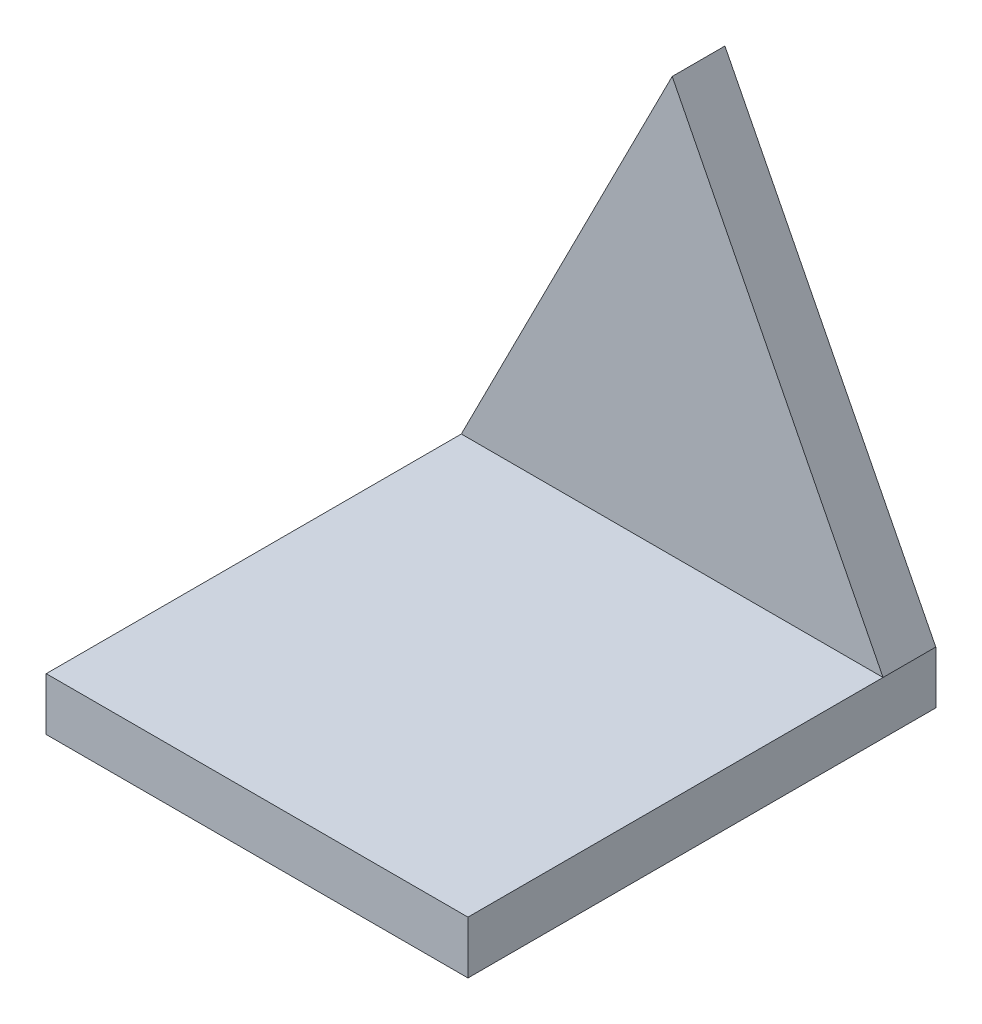
ISO-10303-21;
HEADER;
FILE_DESCRIPTION(('STEP AP214'),'2;1');
FILE_NAME('part.step','',(''),(''),'','','');
FILE_SCHEMA(('AUTOMOTIVE_DESIGN { 1 0 10303 214 1 1 1 1 }'));
ENDSEC;
DATA;
#1=APPLICATION_CONTEXT('core data for automotive mechanical design processes');
#2=APPLICATION_PROTOCOL_DEFINITION('international standard','automotive_design',2000,#1);
#3=PRODUCT_CONTEXT('',#1,'mechanical');
#4=PRODUCT('Part','Part','',(#3));
#5=PRODUCT_RELATED_PRODUCT_CATEGORY('part','',(#4));
#6=PRODUCT_DEFINITION_FORMATION('','',#4);
#7=PRODUCT_DEFINITION_CONTEXT('part definition',#1,'design');
#8=PRODUCT_DEFINITION('design','',#6,#7);
#9=PRODUCT_DEFINITION_SHAPE('','',#8);
#10=(LENGTH_UNIT() NAMED_UNIT(*) SI_UNIT(.MILLI.,.METRE.));
#11=(NAMED_UNIT(*) PLANE_ANGLE_UNIT() SI_UNIT($,.RADIAN.));
#12=(NAMED_UNIT(*) SI_UNIT($,.STERADIAN.) SOLID_ANGLE_UNIT());
#13=UNCERTAINTY_MEASURE_WITH_UNIT(LENGTH_MEASURE(1.E-05),#10,'distance_accuracy_value','');
#14=(GEOMETRIC_REPRESENTATION_CONTEXT(3) GLOBAL_UNCERTAINTY_ASSIGNED_CONTEXT((#13)) GLOBAL_UNIT_ASSIGNED_CONTEXT((#10,
#11,#12)) REPRESENTATION_CONTEXT('',''));
#15=CARTESIAN_POINT('',(0.,0.,0.));
#16=DIRECTION('',(0.,0.,1.));
#17=DIRECTION('',(1.,0.,0.));
#18=AXIS2_PLACEMENT_3D('',#15,#16,#17);
#19=CARTESIAN_POINT('',(0.,3.175,0.));
#20=DIRECTION('',(1.,0.,0.));
#21=DIRECTION('',(0.,0.,-1.));
#22=AXIS2_PLACEMENT_3D('',#19,#20,#21);
#23=PLANE('',#22);
#24=DIRECTION('',(0.,0.,-1.));
#25=VECTOR('',#24,1.);
#26=CARTESIAN_POINT('',(0.,3.175,65.3160269781736));
#27=LINE('',#26,#25);
#28=CARTESIAN_POINT('',(0.,3.175,-25.));
#29=VERTEX_POINT('',#28);
#30=CARTESIAN_POINT('',(0.,3.175,-28.175));
#31=VERTEX_POINT('',#30);
#32=EDGE_CURVE('E56',#29,#31,#27,.T.);
#33=ORIENTED_EDGE('',*,*,#32,.T.);
#34=DIRECTION('',(0.,-1.,0.));
#35=VECTOR('',#34,1.);
#36=CARTESIAN_POINT('',(0.,3.175,-28.175));
#37=LINE('',#36,#35);
#38=CARTESIAN_POINT('',(0.,0.,-28.175));
#39=VERTEX_POINT('',#38);
#40=EDGE_CURVE('E104',#31,#39,#37,.T.);
#41=ORIENTED_EDGE('',*,*,#40,.T.);
#42=DIRECTION('',(0.,0.,1.));
#43=VECTOR('',#42,1.);
#44=CARTESIAN_POINT('',(0.,0.,0.));
#45=LINE('',#44,#43);
#46=CARTESIAN_POINT('',(0.,0.,0.));
#47=VERTEX_POINT('',#46);
#48=EDGE_CURVE('E93',#39,#47,#45,.T.);
#49=ORIENTED_EDGE('',*,*,#48,.T.);
#50=DIRECTION('',(0.,-1.,0.));
#51=VECTOR('',#50,1.);
#52=CARTESIAN_POINT('',(0.,3.175,0.));
#53=LINE('',#52,#51);
#54=CARTESIAN_POINT('',(0.,3.175,0.));
#55=VERTEX_POINT('',#54);
#56=EDGE_CURVE('E11',#55,#47,#53,.T.);
#57=ORIENTED_EDGE('',*,*,#56,.F.);
#58=DIRECTION('',(0.,0.,1.));
#59=VECTOR('',#58,1.);
#60=CARTESIAN_POINT('',(0.,3.175,0.));
#61=LINE('',#60,#59);
#62=EDGE_CURVE('E139',#29,#55,#61,.T.);
#63=ORIENTED_EDGE('',*,*,#62,.F.);
#64=EDGE_LOOP('',(#33,#41,#49,#57,#63));
#65=FACE_BOUND('',#64,.T.);
#66=ADVANCED_FACE('F31',(#65),#23,.F.);
#67=CARTESIAN_POINT('',(25.4,3.175,0.));
#68=DIRECTION('',(-1.,0.,0.));
#69=DIRECTION('',(0.,0.,1.));
#70=AXIS2_PLACEMENT_3D('',#67,#68,#69);
#71=PLANE('',#70);
#72=DIRECTION('',(0.,0.,-1.));
#73=VECTOR('',#72,1.);
#74=CARTESIAN_POINT('',(25.4,3.175,65.3160269781736));
#75=LINE('',#74,#73);
#76=CARTESIAN_POINT('',(25.4,3.175,-25.));
#77=VERTEX_POINT('',#76);
#78=CARTESIAN_POINT('',(25.4,3.175,-28.175));
#79=VERTEX_POINT('',#78);
#80=EDGE_CURVE('E106',#77,#79,#75,.T.);
#81=ORIENTED_EDGE('',*,*,#80,.F.);
#82=DIRECTION('',(0.,0.,-1.));
#83=VECTOR('',#82,1.);
#84=CARTESIAN_POINT('',(25.4,3.175,0.));
#85=LINE('',#84,#83);
#86=CARTESIAN_POINT('',(25.4,3.175,0.));
#87=VERTEX_POINT('',#86);
#88=EDGE_CURVE('E96',#87,#77,#85,.T.);
#89=ORIENTED_EDGE('',*,*,#88,.F.);
#90=DIRECTION('',(0.,-1.,0.));
#91=VECTOR('',#90,1.);
#92=CARTESIAN_POINT('',(25.4,3.175,0.));
#93=LINE('',#92,#91);
#94=CARTESIAN_POINT('',(25.4,0.,0.));
#95=VERTEX_POINT('',#94);
#96=EDGE_CURVE('E40',#87,#95,#93,.T.);
#97=ORIENTED_EDGE('',*,*,#96,.T.);
#98=DIRECTION('',(0.,0.,-1.));
#99=VECTOR('',#98,1.);
#100=CARTESIAN_POINT('',(25.4,0.,0.));
#101=LINE('',#100,#99);
#102=CARTESIAN_POINT('',(25.4,0.,-28.175));
#103=VERTEX_POINT('',#102);
#104=EDGE_CURVE('E148',#95,#103,#101,.T.);
#105=ORIENTED_EDGE('',*,*,#104,.T.);
#106=DIRECTION('',(0.,-1.,0.));
#107=VECTOR('',#106,1.);
#108=CARTESIAN_POINT('',(25.4,3.175,-28.175));
#109=LINE('',#108,#107);
#110=EDGE_CURVE('E109',#79,#103,#109,.T.);
#111=ORIENTED_EDGE('',*,*,#110,.F.);
#112=EDGE_LOOP('',(#81,#89,#97,#105,#111));
#113=FACE_BOUND('',#112,.T.);
#114=ADVANCED_FACE('F107',(#113),#71,.F.);
#115=CARTESIAN_POINT('',(0.,3.175,-28.175));
#116=DIRECTION('',(0.,0.,1.));
#117=DIRECTION('',(1.,0.,0.));
#118=AXIS2_PLACEMENT_3D('',#115,#116,#117);
#119=PLANE('',#118);
#120=DIRECTION('',(-0.452910453651516,-0.891556011125032,0.));
#121=VECTOR('',#120,1.);
#122=CARTESIAN_POINT('',(0.,3.175,-28.175));
#123=LINE('',#122,#121);
#124=CARTESIAN_POINT('',(12.7,28.175,-28.175));
#125=VERTEX_POINT('',#124);
#126=EDGE_CURVE('E94',#125,#31,#123,.T.);
#127=ORIENTED_EDGE('',*,*,#126,.F.);
#128=DIRECTION('',(-0.452910453651516,0.891556011125032,0.));
#129=VECTOR('',#128,1.);
#130=CARTESIAN_POINT('',(20.1897518727187,13.4313939513411,-28.175));
#131=LINE('',#130,#129);
#132=EDGE_CURVE('E48',#79,#125,#131,.T.);
#133=ORIENTED_EDGE('',*,*,#132,.F.);
#134=ORIENTED_EDGE('',*,*,#110,.T.);
#135=DIRECTION('',(-1.,0.,0.));
#136=VECTOR('',#135,1.);
#137=CARTESIAN_POINT('',(0.,0.,-28.175));
#138=LINE('',#137,#136);
#139=EDGE_CURVE('E140',#103,#39,#138,.T.);
#140=ORIENTED_EDGE('',*,*,#139,.T.);
#141=ORIENTED_EDGE('',*,*,#40,.F.);
#142=EDGE_LOOP('',(#127,#133,#134,#140,#141));
#143=FACE_BOUND('',#142,.T.);
#144=ADVANCED_FACE('F159',(#143),#119,.F.);
#145=CARTESIAN_POINT('',(0.,28.175,-25.));
#146=DIRECTION('',(0.,0.,-1.));
#147=DIRECTION('',(-1.,0.,0.));
#148=AXIS2_PLACEMENT_3D('',#145,#146,#147);
#149=PLANE('',#148);
#150=DIRECTION('',(0.452910453651516,0.891556011125032,0.));
#151=VECTOR('',#150,1.);
#152=CARTESIAN_POINT('',(10.0948759363594,23.0468030243294,-25.));
#153=LINE('',#152,#151);
#154=CARTESIAN_POINT('',(12.7,28.175,-25.));
#155=VERTEX_POINT('',#154);
#156=EDGE_CURVE('E91',#29,#155,#153,.T.);
#157=ORIENTED_EDGE('',*,*,#156,.F.);
#158=DIRECTION('',(1.,0.,0.));
#159=VECTOR('',#158,1.);
#160=CARTESIAN_POINT('',(0.,3.175,-25.));
#161=LINE('',#160,#159);
#162=EDGE_CURVE('E34',#29,#77,#161,.T.);
#163=ORIENTED_EDGE('',*,*,#162,.T.);
#164=DIRECTION('',(0.452910453651516,-0.891556011125032,0.));
#165=VECTOR('',#164,1.);
#166=CARTESIAN_POINT('',(10.0948759363594,33.3031969756706,-25.));
#167=LINE('',#166,#165);
#168=EDGE_CURVE('E89',#155,#77,#167,.T.);
#169=ORIENTED_EDGE('',*,*,#168,.F.);
#170=EDGE_LOOP('',(#157,#163,#169));
#171=FACE_BOUND('',#170,.T.);
#172=ADVANCED_FACE('F87',(#171),#149,.F.);
#173=CARTESIAN_POINT('',(0.,3.175,-28.175));
#174=DIRECTION('',(0.,-1.,0.));
#175=DIRECTION('',(0.,0.,-1.));
#176=AXIS2_PLACEMENT_3D('',#173,#174,#175);
#177=PLANE('',#176);
#178=ORIENTED_EDGE('',*,*,#162,.F.);
#179=ORIENTED_EDGE('',*,*,#62,.T.);
#180=DIRECTION('',(1.,0.,0.));
#181=VECTOR('',#180,1.);
#182=CARTESIAN_POINT('',(0.,3.175,0.));
#183=LINE('',#182,#181);
#184=EDGE_CURVE('E100',#55,#87,#183,.T.);
#185=ORIENTED_EDGE('',*,*,#184,.T.);
#186=ORIENTED_EDGE('',*,*,#88,.T.);
#187=EDGE_LOOP('',(#178,#179,#185,#186));
#188=FACE_BOUND('',#187,.T.);
#189=ADVANCED_FACE('F98',(#188),#177,.F.);
#190=CARTESIAN_POINT('',(0.,3.175,0.));
#191=DIRECTION('',(0.,0.,-1.));
#192=DIRECTION('',(-1.,0.,0.));
#193=AXIS2_PLACEMENT_3D('',#190,#191,#192);
#194=PLANE('',#193);
#195=DIRECTION('',(1.,0.,0.));
#196=VECTOR('',#195,1.);
#197=CARTESIAN_POINT('',(0.,0.,0.));
#198=LINE('',#197,#196);
#199=EDGE_CURVE('E146',#47,#95,#198,.T.);
#200=ORIENTED_EDGE('',*,*,#199,.T.);
#201=ORIENTED_EDGE('',*,*,#96,.F.);
#202=ORIENTED_EDGE('',*,*,#184,.F.);
#203=ORIENTED_EDGE('',*,*,#56,.T.);
#204=EDGE_LOOP('',(#200,#201,#202,#203));
#205=FACE_BOUND('',#204,.T.);
#206=ADVANCED_FACE('F161',(#205),#194,.F.);
#207=CARTESIAN_POINT('',(0.,0.,-28.175));
#208=DIRECTION('',(0.,-1.,0.));
#209=DIRECTION('',(0.,0.,-1.));
#210=AXIS2_PLACEMENT_3D('',#207,#208,#209);
#211=PLANE('',#210);
#212=ORIENTED_EDGE('',*,*,#48,.F.);
#213=ORIENTED_EDGE('',*,*,#139,.F.);
#214=ORIENTED_EDGE('',*,*,#104,.F.);
#215=ORIENTED_EDGE('',*,*,#199,.F.);
#216=EDGE_LOOP('',(#212,#213,#214,#215));
#217=FACE_BOUND('',#216,.T.);
#218=ADVANCED_FACE('F158',(#217),#211,.T.);
#219=CARTESIAN_POINT('',(0.,3.175,65.3160269781736));
#220=DIRECTION('',(-0.891556011125032,0.452910453651516,0.));
#221=DIRECTION('',(-0.452910453651516,-0.891556011125032,0.));
#222=AXIS2_PLACEMENT_3D('',#219,#220,#221);
#223=PLANE('',#222);
#224=DIRECTION('',(0.,0.,-1.));
#225=VECTOR('',#224,1.);
#226=CARTESIAN_POINT('',(12.7,28.175,65.3160269781736));
#227=LINE('',#226,#225);
#228=EDGE_CURVE('E111',#155,#125,#227,.T.);
#229=ORIENTED_EDGE('',*,*,#228,.T.);
#230=ORIENTED_EDGE('',*,*,#126,.T.);
#231=ORIENTED_EDGE('',*,*,#32,.F.);
#232=ORIENTED_EDGE('',*,*,#156,.T.);
#233=EDGE_LOOP('',(#229,#230,#231,#232));
#234=FACE_BOUND('',#233,.T.);
#235=ADVANCED_FACE('F130',(#234),#223,.T.);
#236=CARTESIAN_POINT('',(12.7,28.175,65.3160269781736));
#237=DIRECTION('',(0.891556011125032,0.452910453651516,0.));
#238=DIRECTION('',(-0.452910453651516,0.891556011125032,0.));
#239=AXIS2_PLACEMENT_3D('',#236,#237,#238);
#240=PLANE('',#239);
#241=ORIENTED_EDGE('',*,*,#80,.T.);
#242=ORIENTED_EDGE('',*,*,#132,.T.);
#243=ORIENTED_EDGE('',*,*,#228,.F.);
#244=ORIENTED_EDGE('',*,*,#168,.T.);
#245=EDGE_LOOP('',(#241,#242,#243,#244));
#246=FACE_BOUND('',#245,.T.);
#247=ADVANCED_FACE('F114',(#246),#240,.T.);
#248=CLOSED_SHELL('',(#66,#114,#144,#172,#189,#206,#218,#235,#247));
#249=MANIFOLD_SOLID_BREP('B2',#248);
#250=ADVANCED_BREP_SHAPE_REPRESENTATION('',(#18,#249),#14);
#251=SHAPE_DEFINITION_REPRESENTATION(#9,#250);
ENDSEC;
END-ISO-10303-21;
